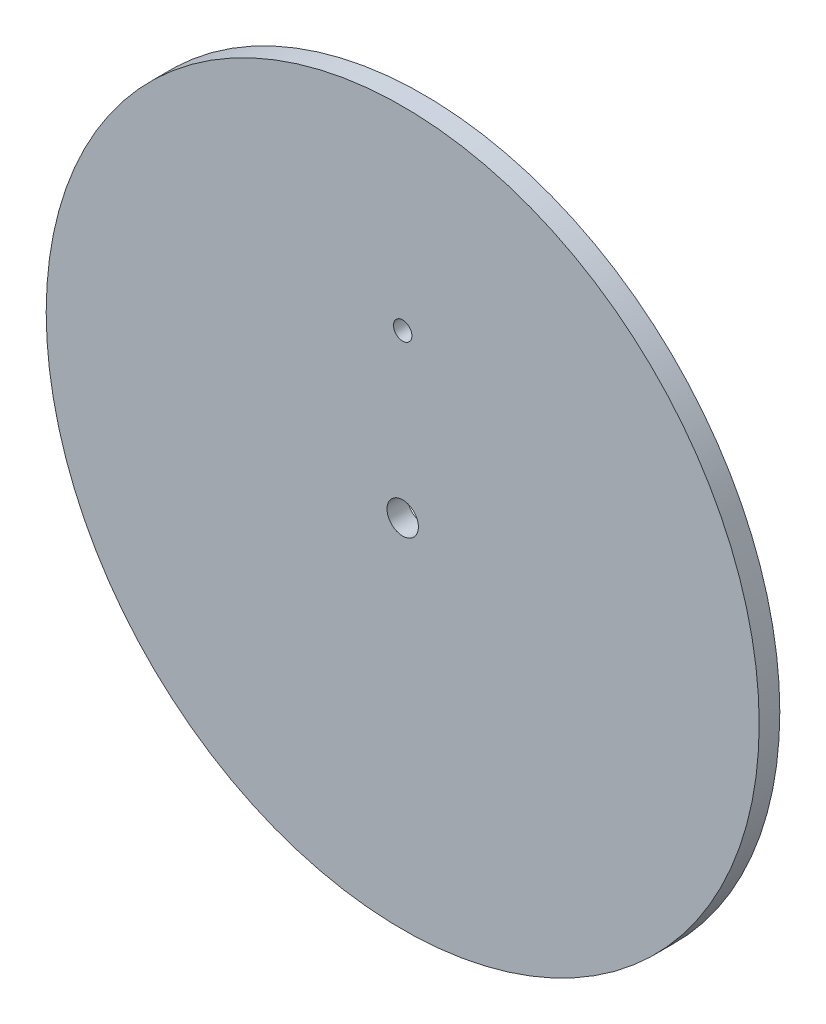
ISO-10303-21;
HEADER;
FILE_DESCRIPTION(('STEP AP214'),'2;1');
FILE_NAME('part.step','',(''),(''),'','','');
FILE_SCHEMA(('AUTOMOTIVE_DESIGN { 1 0 10303 214 1 1 1 1 }'));
ENDSEC;
DATA;
#1=APPLICATION_CONTEXT('core data for automotive mechanical design processes');
#2=APPLICATION_PROTOCOL_DEFINITION('international standard','automotive_design',2000,#1);
#3=PRODUCT_CONTEXT('',#1,'mechanical');
#4=PRODUCT('Part','Part','',(#3));
#5=PRODUCT_RELATED_PRODUCT_CATEGORY('part','',(#4));
#6=PRODUCT_DEFINITION_FORMATION('','',#4);
#7=PRODUCT_DEFINITION_CONTEXT('part definition',#1,'design');
#8=PRODUCT_DEFINITION('design','',#6,#7);
#9=PRODUCT_DEFINITION_SHAPE('','',#8);
#10=(LENGTH_UNIT() NAMED_UNIT(*) SI_UNIT(.MILLI.,.METRE.));
#11=(NAMED_UNIT(*) PLANE_ANGLE_UNIT() SI_UNIT($,.RADIAN.));
#12=(NAMED_UNIT(*) SI_UNIT($,.STERADIAN.) SOLID_ANGLE_UNIT());
#13=UNCERTAINTY_MEASURE_WITH_UNIT(LENGTH_MEASURE(1.E-05),#10,'distance_accuracy_value','');
#14=(GEOMETRIC_REPRESENTATION_CONTEXT(3) GLOBAL_UNCERTAINTY_ASSIGNED_CONTEXT((#13)) GLOBAL_UNIT_ASSIGNED_CONTEXT((#10,
#11,#12)) REPRESENTATION_CONTEXT('',''));
#15=CARTESIAN_POINT('',(0.,0.,0.));
#16=DIRECTION('',(0.,0.,1.));
#17=DIRECTION('',(1.,0.,0.));
#18=AXIS2_PLACEMENT_3D('',#15,#16,#17);
#19=CARTESIAN_POINT('',(0.,0.,3.175));
#20=DIRECTION('',(0.,0.,1.));
#21=DIRECTION('',(1.,0.,0.));
#22=AXIS2_PLACEMENT_3D('',#19,#20,#21);
#23=PLANE('',#22);
#24=CARTESIAN_POINT('',(0.,0.,3.175));
#25=DIRECTION('',(0.,0.,1.));
#26=DIRECTION('',(1.,0.,0.));
#27=AXIS2_PLACEMENT_3D('',#24,#25,#26);
#28=CIRCLE('',#27,2.415);
#29=CARTESIAN_POINT('',(2.415,0.,3.175));
#30=VERTEX_POINT('',#29);
#31=EDGE_CURVE('E50',#30,#30,#28,.T.);
#32=ORIENTED_EDGE('',*,*,#31,.F.);
#33=EDGE_LOOP('',(#32));
#34=FACE_BOUND('',#33,.T.);
#35=CARTESIAN_POINT('',(0.,0.,3.175));
#36=DIRECTION('',(0.,0.,1.));
#37=DIRECTION('',(1.,0.,0.));
#38=AXIS2_PLACEMENT_3D('',#35,#36,#37);
#39=CIRCLE('',#38,54.915);
#40=CARTESIAN_POINT('',(54.915,0.,3.175));
#41=VERTEX_POINT('',#40);
#42=EDGE_CURVE('E10',#41,#41,#39,.T.);
#43=ORIENTED_EDGE('',*,*,#42,.T.);
#44=EDGE_LOOP('',(#43));
#45=FACE_BOUND('',#44,.T.);
#46=CARTESIAN_POINT('',(0.,25.,3.175));
#47=DIRECTION('',(0.,0.,1.));
#48=DIRECTION('',(1.,0.,0.));
#49=AXIS2_PLACEMENT_3D('',#46,#47,#48);
#50=CIRCLE('',#49,1.415);
#51=CARTESIAN_POINT('',(1.415,25.,3.175));
#52=VERTEX_POINT('',#51);
#53=EDGE_CURVE('E56',#52,#52,#50,.T.);
#54=ORIENTED_EDGE('',*,*,#53,.F.);
#55=EDGE_LOOP('',(#54));
#56=FACE_BOUND('',#55,.T.);
#57=ADVANCED_FACE('F37',(#34,#45,#56),#23,.T.);
#58=CARTESIAN_POINT('',(0.,0.,0.));
#59=DIRECTION('',(0.,0.,1.));
#60=DIRECTION('',(1.,0.,0.));
#61=AXIS2_PLACEMENT_3D('',#58,#59,#60);
#62=PLANE('',#61);
#63=CARTESIAN_POINT('',(0.,0.,0.));
#64=DIRECTION('',(0.,0.,1.));
#65=DIRECTION('',(1.,0.,0.));
#66=AXIS2_PLACEMENT_3D('',#63,#64,#65);
#67=CIRCLE('',#66,54.915);
#68=CARTESIAN_POINT('',(54.915,0.,0.));
#69=VERTEX_POINT('',#68);
#70=EDGE_CURVE('E41',#69,#69,#67,.T.);
#71=ORIENTED_EDGE('',*,*,#70,.F.);
#72=EDGE_LOOP('',(#71));
#73=FACE_BOUND('',#72,.T.);
#74=CARTESIAN_POINT('',(0.,0.,0.));
#75=DIRECTION('',(0.,0.,1.));
#76=DIRECTION('',(1.,0.,0.));
#77=AXIS2_PLACEMENT_3D('',#74,#75,#76);
#78=CIRCLE('',#77,2.415);
#79=CARTESIAN_POINT('',(2.415,0.,0.));
#80=VERTEX_POINT('',#79);
#81=EDGE_CURVE('E52',#80,#80,#78,.T.);
#82=ORIENTED_EDGE('',*,*,#81,.T.);
#83=EDGE_LOOP('',(#82));
#84=FACE_BOUND('',#83,.T.);
#85=CARTESIAN_POINT('',(0.,25.,0.));
#86=DIRECTION('',(0.,0.,1.));
#87=DIRECTION('',(1.,0.,0.));
#88=AXIS2_PLACEMENT_3D('',#85,#86,#87);
#89=CIRCLE('',#88,1.415);
#90=CARTESIAN_POINT('',(1.415,25.,0.));
#91=VERTEX_POINT('',#90);
#92=EDGE_CURVE('E60',#91,#91,#89,.T.);
#93=ORIENTED_EDGE('',*,*,#92,.T.);
#94=EDGE_LOOP('',(#93));
#95=FACE_BOUND('',#94,.T.);
#96=ADVANCED_FACE('F72',(#73,#84,#95),#62,.F.);
#97=CARTESIAN_POINT('',(0.,0.,3.175));
#98=DIRECTION('',(0.,0.,-1.));
#99=DIRECTION('',(-1.,0.,0.));
#100=AXIS2_PLACEMENT_3D('',#97,#98,#99);
#101=CYLINDRICAL_SURFACE('',#100,54.915);
#102=ORIENTED_EDGE('',*,*,#42,.F.);
#103=EDGE_LOOP('',(#102));
#104=FACE_BOUND('',#103,.T.);
#105=ORIENTED_EDGE('',*,*,#70,.T.);
#106=EDGE_LOOP('',(#105));
#107=FACE_BOUND('',#106,.T.);
#108=ADVANCED_FACE('F39',(#104,#107),#101,.T.);
#109=CARTESIAN_POINT('',(0.,0.,3.175));
#110=DIRECTION('',(0.,0.,-1.));
#111=DIRECTION('',(-1.,0.,0.));
#112=AXIS2_PLACEMENT_3D('',#109,#110,#111);
#113=CYLINDRICAL_SURFACE('',#112,2.415);
#114=ORIENTED_EDGE('',*,*,#31,.T.);
#115=EDGE_LOOP('',(#114));
#116=FACE_BOUND('',#115,.T.);
#117=ORIENTED_EDGE('',*,*,#81,.F.);
#118=EDGE_LOOP('',(#117));
#119=FACE_BOUND('',#118,.T.);
#120=ADVANCED_FACE('F81',(#116,#119),#113,.F.);
#121=CARTESIAN_POINT('',(0.,25.,3.175));
#122=DIRECTION('',(0.,0.,-1.));
#123=DIRECTION('',(-1.,0.,0.));
#124=AXIS2_PLACEMENT_3D('',#121,#122,#123);
#125=CYLINDRICAL_SURFACE('',#124,1.415);
#126=ORIENTED_EDGE('',*,*,#53,.T.);
#127=EDGE_LOOP('',(#126));
#128=FACE_BOUND('',#127,.T.);
#129=ORIENTED_EDGE('',*,*,#92,.F.);
#130=EDGE_LOOP('',(#129));
#131=FACE_BOUND('',#130,.T.);
#132=ADVANCED_FACE('F68',(#128,#131),#125,.F.);
#133=CLOSED_SHELL('',(#57,#96,#108,#120,#132));
#134=MANIFOLD_SOLID_BREP('B2',#133);
#135=ADVANCED_BREP_SHAPE_REPRESENTATION('',(#18,#134),#14);
#136=SHAPE_DEFINITION_REPRESENTATION(#9,#135);
ENDSEC;
END-ISO-10303-21;
